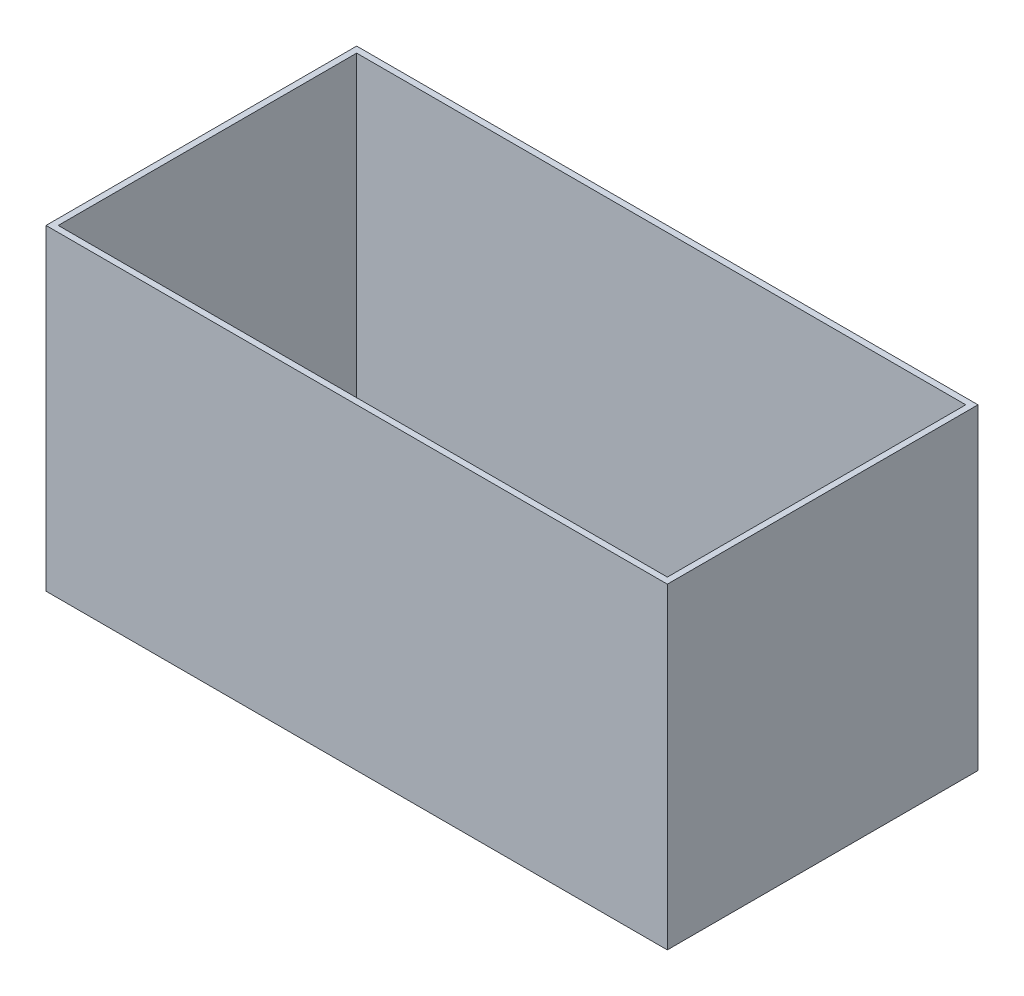
ISO-10303-21;
HEADER;
FILE_DESCRIPTION(('STEP AP214'),'2;1');
FILE_NAME('part.step','',(''),(''),'','','');
FILE_SCHEMA(('AUTOMOTIVE_DESIGN { 1 0 10303 214 1 1 1 1 }'));
ENDSEC;
DATA;
#1=APPLICATION_CONTEXT('core data for automotive mechanical design processes');
#2=APPLICATION_PROTOCOL_DEFINITION('international standard','automotive_design',2000,#1);
#3=PRODUCT_CONTEXT('',#1,'mechanical');
#4=PRODUCT('Part','Part','',(#3));
#5=PRODUCT_RELATED_PRODUCT_CATEGORY('part','',(#4));
#6=PRODUCT_DEFINITION_FORMATION('','',#4);
#7=PRODUCT_DEFINITION_CONTEXT('part definition',#1,'design');
#8=PRODUCT_DEFINITION('design','',#6,#7);
#9=PRODUCT_DEFINITION_SHAPE('','',#8);
#10=(LENGTH_UNIT() NAMED_UNIT(*) SI_UNIT(.MILLI.,.METRE.));
#11=(NAMED_UNIT(*) PLANE_ANGLE_UNIT() SI_UNIT($,.RADIAN.));
#12=(NAMED_UNIT(*) SI_UNIT($,.STERADIAN.) SOLID_ANGLE_UNIT());
#13=UNCERTAINTY_MEASURE_WITH_UNIT(LENGTH_MEASURE(1.E-05),#10,'distance_accuracy_value','');
#14=(GEOMETRIC_REPRESENTATION_CONTEXT(3) GLOBAL_UNCERTAINTY_ASSIGNED_CONTEXT((#13)) GLOBAL_UNIT_ASSIGNED_CONTEXT((#10,
#11,#12)) REPRESENTATION_CONTEXT('',''));
#15=CARTESIAN_POINT('',(0.,0.,0.));
#16=DIRECTION('',(0.,0.,1.));
#17=DIRECTION('',(1.,0.,0.));
#18=AXIS2_PLACEMENT_3D('',#15,#16,#17);
#19=CARTESIAN_POINT('',(-152.4,-3.,-76.2));
#20=DIRECTION('',(0.,1.,0.));
#21=DIRECTION('',(0.,0.,1.));
#22=AXIS2_PLACEMENT_3D('',#19,#20,#21);
#23=PLANE('',#22);
#24=DIRECTION('',(1.,0.,0.));
#25=VECTOR('',#24,1.);
#26=CARTESIAN_POINT('',(0.,-3.,-76.2));
#27=LINE('',#26,#25);
#28=CARTESIAN_POINT('',(-152.4,-3.,-76.2));
#29=VERTEX_POINT('',#28);
#30=CARTESIAN_POINT('',(152.4,-3.,-76.2));
#31=VERTEX_POINT('',#30);
#32=EDGE_CURVE('E101',#29,#31,#27,.T.);
#33=ORIENTED_EDGE('',*,*,#32,.T.);
#34=DIRECTION('',(0.,0.,1.));
#35=VECTOR('',#34,1.);
#36=CARTESIAN_POINT('',(152.4,-3.,0.));
#37=LINE('',#36,#35);
#38=CARTESIAN_POINT('',(152.4,-3.,76.2));
#39=VERTEX_POINT('',#38);
#40=EDGE_CURVE('E83',#31,#39,#37,.T.);
#41=ORIENTED_EDGE('',*,*,#40,.T.);
#42=DIRECTION('',(-1.,0.,0.));
#43=VECTOR('',#42,1.);
#44=CARTESIAN_POINT('',(0.,-3.,76.2));
#45=LINE('',#44,#43);
#46=CARTESIAN_POINT('',(-152.4,-3.,76.2));
#47=VERTEX_POINT('',#46);
#48=EDGE_CURVE('E21',#39,#47,#45,.T.);
#49=ORIENTED_EDGE('',*,*,#48,.T.);
#50=DIRECTION('',(0.,0.,-1.));
#51=VECTOR('',#50,1.);
#52=CARTESIAN_POINT('',(-152.4,-3.,0.));
#53=LINE('',#52,#51);
#54=EDGE_CURVE('E79',#47,#29,#53,.T.);
#55=ORIENTED_EDGE('',*,*,#54,.T.);
#56=EDGE_LOOP('',(#33,#41,#49,#55));
#57=FACE_BOUND('',#56,.T.);
#58=ADVANCED_FACE('F17',(#57),#23,.F.);
#59=CARTESIAN_POINT('',(-149.4,0.,-73.2));
#60=DIRECTION('',(0.,1.,0.));
#61=DIRECTION('',(0.,0.,1.));
#62=AXIS2_PLACEMENT_3D('',#59,#60,#61);
#63=PLANE('',#62);
#64=DIRECTION('',(-1.,0.,0.));
#65=VECTOR('',#64,1.);
#66=CARTESIAN_POINT('',(0.,0.,73.2));
#67=LINE('',#66,#65);
#68=CARTESIAN_POINT('',(149.4,0.,73.2));
#69=VERTEX_POINT('',#68);
#70=CARTESIAN_POINT('',(-149.4,0.,73.2));
#71=VERTEX_POINT('',#70);
#72=EDGE_CURVE('E109',#69,#71,#67,.T.);
#73=ORIENTED_EDGE('',*,*,#72,.F.);
#74=DIRECTION('',(0.,0.,1.));
#75=VECTOR('',#74,1.);
#76=CARTESIAN_POINT('',(149.4,0.,0.));
#77=LINE('',#76,#75);
#78=CARTESIAN_POINT('',(149.4,0.,-73.2));
#79=VERTEX_POINT('',#78);
#80=EDGE_CURVE('E111',#79,#69,#77,.T.);
#81=ORIENTED_EDGE('',*,*,#80,.F.);
#82=DIRECTION('',(1.,0.,0.));
#83=VECTOR('',#82,1.);
#84=CARTESIAN_POINT('',(0.,0.,-73.2));
#85=LINE('',#84,#83);
#86=CARTESIAN_POINT('',(-149.4,0.,-73.2));
#87=VERTEX_POINT('',#86);
#88=EDGE_CURVE('E115',#87,#79,#85,.T.);
#89=ORIENTED_EDGE('',*,*,#88,.F.);
#90=DIRECTION('',(0.,0.,-1.));
#91=VECTOR('',#90,1.);
#92=CARTESIAN_POINT('',(-149.4,0.,0.));
#93=LINE('',#92,#91);
#94=EDGE_CURVE('E119',#71,#87,#93,.T.);
#95=ORIENTED_EDGE('',*,*,#94,.F.);
#96=EDGE_LOOP('',(#73,#81,#89,#95));
#97=FACE_BOUND('',#96,.T.);
#98=ADVANCED_FACE('F182',(#97),#63,.T.);
#99=CARTESIAN_POINT('',(152.4,-3.,76.2));
#100=DIRECTION('',(0.,0.,-1.));
#101=DIRECTION('',(-1.,0.,0.));
#102=AXIS2_PLACEMENT_3D('',#99,#100,#101);
#103=PLANE('',#102);
#104=ORIENTED_EDGE('',*,*,#48,.F.);
#105=DIRECTION('',(0.,1.,0.));
#106=VECTOR('',#105,1.);
#107=CARTESIAN_POINT('',(152.4,74.7,76.2));
#108=LINE('',#107,#106);
#109=CARTESIAN_POINT('',(152.4,152.4,76.2));
#110=VERTEX_POINT('',#109);
#111=EDGE_CURVE('E107',#39,#110,#108,.T.);
#112=ORIENTED_EDGE('',*,*,#111,.T.);
#113=DIRECTION('',(-1.,0.,0.));
#114=VECTOR('',#113,1.);
#115=CARTESIAN_POINT('',(0.,152.4,76.2));
#116=LINE('',#115,#114);
#117=CARTESIAN_POINT('',(-152.4,152.4,76.2));
#118=VERTEX_POINT('',#117);
#119=EDGE_CURVE('E98',#110,#118,#116,.T.);
#120=ORIENTED_EDGE('',*,*,#119,.T.);
#121=DIRECTION('',(0.,-1.,0.));
#122=VECTOR('',#121,1.);
#123=CARTESIAN_POINT('',(-152.4,74.7,76.2));
#124=LINE('',#123,#122);
#125=EDGE_CURVE('E88',#118,#47,#124,.T.);
#126=ORIENTED_EDGE('',*,*,#125,.T.);
#127=EDGE_LOOP('',(#104,#112,#120,#126));
#128=FACE_BOUND('',#127,.T.);
#129=ADVANCED_FACE('F97',(#128),#103,.F.);
#130=CARTESIAN_POINT('',(-152.4,-3.,76.2));
#131=DIRECTION('',(1.,0.,0.));
#132=DIRECTION('',(0.,0.,-1.));
#133=AXIS2_PLACEMENT_3D('',#130,#131,#132);
#134=PLANE('',#133);
#135=ORIENTED_EDGE('',*,*,#54,.F.);
#136=ORIENTED_EDGE('',*,*,#125,.F.);
#137=DIRECTION('',(0.,0.,-1.));
#138=VECTOR('',#137,1.);
#139=CARTESIAN_POINT('',(-152.4,152.4,0.));
#140=LINE('',#139,#138);
#141=CARTESIAN_POINT('',(-152.4,152.4,-76.2));
#142=VERTEX_POINT('',#141);
#143=EDGE_CURVE('E126',#118,#142,#140,.T.);
#144=ORIENTED_EDGE('',*,*,#143,.T.);
#145=DIRECTION('',(0.,-1.,0.));
#146=VECTOR('',#145,1.);
#147=CARTESIAN_POINT('',(-152.4,74.7,-76.2));
#148=LINE('',#147,#146);
#149=EDGE_CURVE('E94',#142,#29,#148,.T.);
#150=ORIENTED_EDGE('',*,*,#149,.T.);
#151=EDGE_LOOP('',(#135,#136,#144,#150));
#152=FACE_BOUND('',#151,.T.);
#153=ADVANCED_FACE('F91',(#152),#134,.F.);
#154=CARTESIAN_POINT('',(-152.4,-3.,-76.2));
#155=DIRECTION('',(0.,0.,1.));
#156=DIRECTION('',(1.,0.,0.));
#157=AXIS2_PLACEMENT_3D('',#154,#155,#156);
#158=PLANE('',#157);
#159=ORIENTED_EDGE('',*,*,#32,.F.);
#160=ORIENTED_EDGE('',*,*,#149,.F.);
#161=DIRECTION('',(1.,0.,0.));
#162=VECTOR('',#161,1.);
#163=CARTESIAN_POINT('',(0.,152.4,-76.2));
#164=LINE('',#163,#162);
#165=CARTESIAN_POINT('',(152.4,152.4,-76.2));
#166=VERTEX_POINT('',#165);
#167=EDGE_CURVE('E128',#142,#166,#164,.T.);
#168=ORIENTED_EDGE('',*,*,#167,.T.);
#169=DIRECTION('',(0.,-1.,0.));
#170=VECTOR('',#169,1.);
#171=CARTESIAN_POINT('',(152.4,74.7,-76.2));
#172=LINE('',#171,#170);
#173=EDGE_CURVE('E103',#166,#31,#172,.T.);
#174=ORIENTED_EDGE('',*,*,#173,.T.);
#175=EDGE_LOOP('',(#159,#160,#168,#174));
#176=FACE_BOUND('',#175,.T.);
#177=ADVANCED_FACE('F173',(#176),#158,.F.);
#178=CARTESIAN_POINT('',(152.4,-3.,-76.2));
#179=DIRECTION('',(-1.,0.,0.));
#180=DIRECTION('',(0.,0.,1.));
#181=AXIS2_PLACEMENT_3D('',#178,#179,#180);
#182=PLANE('',#181);
#183=ORIENTED_EDGE('',*,*,#40,.F.);
#184=ORIENTED_EDGE('',*,*,#173,.F.);
#185=DIRECTION('',(0.,0.,1.));
#186=VECTOR('',#185,1.);
#187=CARTESIAN_POINT('',(152.4,152.4,0.));
#188=LINE('',#187,#186);
#189=EDGE_CURVE('E131',#166,#110,#188,.T.);
#190=ORIENTED_EDGE('',*,*,#189,.T.);
#191=ORIENTED_EDGE('',*,*,#111,.F.);
#192=EDGE_LOOP('',(#183,#184,#190,#191));
#193=FACE_BOUND('',#192,.T.);
#194=ADVANCED_FACE('F170',(#193),#182,.F.);
#195=CARTESIAN_POINT('',(149.4,0.,73.2));
#196=DIRECTION('',(0.,0.,-1.));
#197=DIRECTION('',(-1.,0.,0.));
#198=AXIS2_PLACEMENT_3D('',#195,#196,#197);
#199=PLANE('',#198);
#200=DIRECTION('',(1.,0.,0.));
#201=VECTOR('',#200,1.);
#202=CARTESIAN_POINT('',(0.,152.4,73.2000000564));
#203=LINE('',#202,#201);
#204=CARTESIAN_POINT('',(-149.399999976,152.4,73.2000000141));
#205=VERTEX_POINT('',#204);
#206=CARTESIAN_POINT('',(149.399999976,152.4,73.2000000141));
#207=VERTEX_POINT('',#206);
#208=EDGE_CURVE('E134',#205,#207,#203,.T.);
#209=ORIENTED_EDGE('',*,*,#208,.T.);
#210=DIRECTION('',(0.,1.,0.));
#211=VECTOR('',#210,1.);
#212=CARTESIAN_POINT('',(149.4,76.2,73.2));
#213=LINE('',#212,#211);
#214=EDGE_CURVE('E113',#69,#207,#213,.T.);
#215=ORIENTED_EDGE('',*,*,#214,.F.);
#216=ORIENTED_EDGE('',*,*,#72,.T.);
#217=DIRECTION('',(0.,-1.,0.));
#218=VECTOR('',#217,1.);
#219=CARTESIAN_POINT('',(-149.4,76.2,73.2));
#220=LINE('',#219,#218);
#221=EDGE_CURVE('E122',#205,#71,#220,.T.);
#222=ORIENTED_EDGE('',*,*,#221,.F.);
#223=EDGE_LOOP('',(#209,#215,#216,#222));
#224=FACE_BOUND('',#223,.T.);
#225=ADVANCED_FACE('F154',(#224),#199,.T.);
#226=CARTESIAN_POINT('',(149.4,0.,-73.2));
#227=DIRECTION('',(-1.,0.,0.));
#228=DIRECTION('',(0.,0.,1.));
#229=AXIS2_PLACEMENT_3D('',#226,#227,#228);
#230=PLANE('',#229);
#231=DIRECTION('',(0.,0.,-1.));
#232=VECTOR('',#231,1.);
#233=CARTESIAN_POINT('',(149.399999904,152.4,0.));
#234=LINE('',#233,#232);
#235=CARTESIAN_POINT('',(149.399999976,152.4,-73.2000000141));
#236=VERTEX_POINT('',#235);
#237=EDGE_CURVE('E137',#207,#236,#234,.T.);
#238=ORIENTED_EDGE('',*,*,#237,.T.);
#239=DIRECTION('',(0.,1.,0.));
#240=VECTOR('',#239,1.);
#241=CARTESIAN_POINT('',(149.4,76.2,-73.2));
#242=LINE('',#241,#240);
#243=EDGE_CURVE('E117',#79,#236,#242,.T.);
#244=ORIENTED_EDGE('',*,*,#243,.F.);
#245=ORIENTED_EDGE('',*,*,#80,.T.);
#246=ORIENTED_EDGE('',*,*,#214,.T.);
#247=EDGE_LOOP('',(#238,#244,#245,#246));
#248=FACE_BOUND('',#247,.T.);
#249=ADVANCED_FACE('F149',(#248),#230,.T.);
#250=CARTESIAN_POINT('',(-149.4,0.,-73.2));
#251=DIRECTION('',(0.,0.,1.));
#252=DIRECTION('',(1.,0.,0.));
#253=AXIS2_PLACEMENT_3D('',#250,#251,#252);
#254=PLANE('',#253);
#255=DIRECTION('',(-1.,0.,0.));
#256=VECTOR('',#255,1.);
#257=CARTESIAN_POINT('',(0.,152.4,-73.2000000564));
#258=LINE('',#257,#256);
#259=CARTESIAN_POINT('',(-149.399999976,152.4,-73.2000000141));
#260=VERTEX_POINT('',#259);
#261=EDGE_CURVE('E27',#236,#260,#258,.T.);
#262=ORIENTED_EDGE('',*,*,#261,.T.);
#263=DIRECTION('',(0.,1.,0.));
#264=VECTOR('',#263,1.);
#265=CARTESIAN_POINT('',(-149.4,76.2,-73.2));
#266=LINE('',#265,#264);
#267=EDGE_CURVE('E35',#87,#260,#266,.T.);
#268=ORIENTED_EDGE('',*,*,#267,.F.);
#269=ORIENTED_EDGE('',*,*,#88,.T.);
#270=ORIENTED_EDGE('',*,*,#243,.T.);
#271=EDGE_LOOP('',(#262,#268,#269,#270));
#272=FACE_BOUND('',#271,.T.);
#273=ADVANCED_FACE('F143',(#272),#254,.T.);
#274=CARTESIAN_POINT('',(-149.4,0.,73.2));
#275=DIRECTION('',(1.,0.,0.));
#276=DIRECTION('',(0.,0.,-1.));
#277=AXIS2_PLACEMENT_3D('',#274,#275,#276);
#278=PLANE('',#277);
#279=DIRECTION('',(0.,0.,1.));
#280=VECTOR('',#279,1.);
#281=CARTESIAN_POINT('',(-149.399999904,152.4,0.));
#282=LINE('',#281,#280);
#283=EDGE_CURVE('E11',#260,#205,#282,.T.);
#284=ORIENTED_EDGE('',*,*,#283,.T.);
#285=ORIENTED_EDGE('',*,*,#221,.T.);
#286=ORIENTED_EDGE('',*,*,#94,.T.);
#287=ORIENTED_EDGE('',*,*,#267,.T.);
#288=EDGE_LOOP('',(#284,#285,#286,#287));
#289=FACE_BOUND('',#288,.T.);
#290=ADVANCED_FACE('F157',(#289),#278,.T.);
#291=CARTESIAN_POINT('',(-152.4,152.4,76.2));
#292=DIRECTION('',(0.,-1.,0.));
#293=DIRECTION('',(0.,0.,-1.));
#294=AXIS2_PLACEMENT_3D('',#291,#292,#293);
#295=PLANE('',#294);
#296=ORIENTED_EDGE('',*,*,#261,.F.);
#297=ORIENTED_EDGE('',*,*,#237,.F.);
#298=ORIENTED_EDGE('',*,*,#208,.F.);
#299=ORIENTED_EDGE('',*,*,#283,.F.);
#300=EDGE_LOOP('',(#296,#297,#298,#299));
#301=FACE_BOUND('',#300,.T.);
#302=ORIENTED_EDGE('',*,*,#167,.F.);
#303=ORIENTED_EDGE('',*,*,#143,.F.);
#304=ORIENTED_EDGE('',*,*,#119,.F.);
#305=ORIENTED_EDGE('',*,*,#189,.F.);
#306=EDGE_LOOP('',(#302,#303,#304,#305));
#307=FACE_BOUND('',#306,.T.);
#308=ADVANCED_FACE('F19',(#301,#307),#295,.F.);
#309=CLOSED_SHELL('',(#58,#98,#129,#153,#177,#194,#225,#249,#273,#290,#308));
#310=MANIFOLD_SOLID_BREP('B1',#309);
#311=ADVANCED_BREP_SHAPE_REPRESENTATION('',(#18,#310),#14);
#312=SHAPE_DEFINITION_REPRESENTATION(#9,#311);
ENDSEC;
END-ISO-10303-21;
